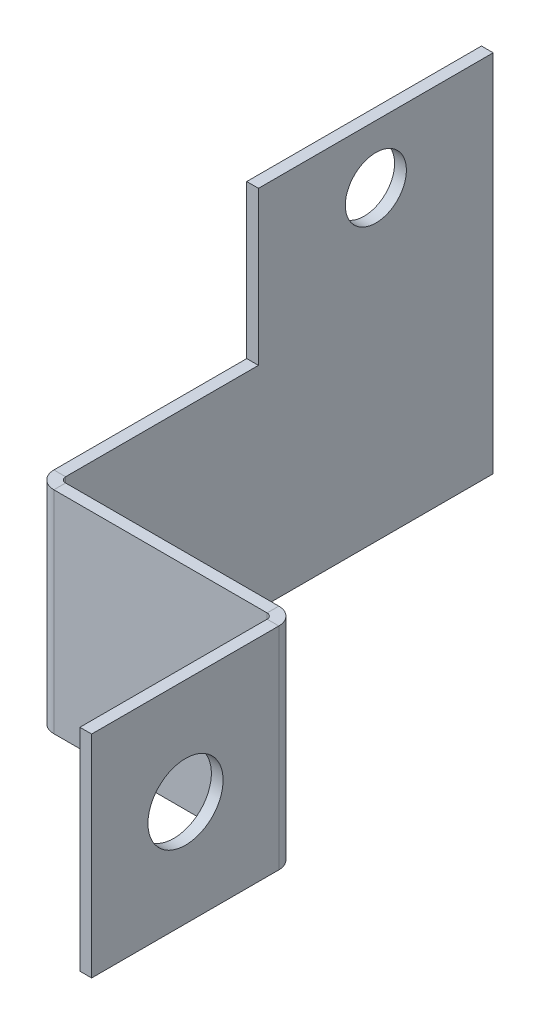
ISO-10303-21;
HEADER;
FILE_DESCRIPTION(('STEP AP214'),'2;1');
FILE_NAME('part.step','',(''),(''),'','','');
FILE_SCHEMA(('AUTOMOTIVE_DESIGN { 1 0 10303 214 1 1 1 1 }'));
ENDSEC;
DATA;
#1=APPLICATION_CONTEXT('core data for automotive mechanical design processes');
#2=APPLICATION_PROTOCOL_DEFINITION('international standard','automotive_design',2000,#1);
#3=PRODUCT_CONTEXT('',#1,'mechanical');
#4=PRODUCT('Part','Part','',(#3));
#5=PRODUCT_RELATED_PRODUCT_CATEGORY('part','',(#4));
#6=PRODUCT_DEFINITION_FORMATION('','',#4);
#7=PRODUCT_DEFINITION_CONTEXT('part definition',#1,'design');
#8=PRODUCT_DEFINITION('design','',#6,#7);
#9=PRODUCT_DEFINITION_SHAPE('','',#8);
#10=(LENGTH_UNIT() NAMED_UNIT(*) SI_UNIT(.MILLI.,.METRE.));
#11=(NAMED_UNIT(*) PLANE_ANGLE_UNIT() SI_UNIT($,.RADIAN.));
#12=(NAMED_UNIT(*) SI_UNIT($,.STERADIAN.) SOLID_ANGLE_UNIT());
#13=UNCERTAINTY_MEASURE_WITH_UNIT(LENGTH_MEASURE(1.E-05),#10,'distance_accuracy_value','');
#14=(GEOMETRIC_REPRESENTATION_CONTEXT(3) GLOBAL_UNCERTAINTY_ASSIGNED_CONTEXT((#13)) GLOBAL_UNIT_ASSIGNED_CONTEXT((#10,
#11,#12)) REPRESENTATION_CONTEXT('',''));
#15=CARTESIAN_POINT('',(0.,0.,0.));
#16=DIRECTION('',(0.,0.,1.));
#17=DIRECTION('',(1.,0.,0.));
#18=AXIS2_PLACEMENT_3D('',#15,#16,#17);
#19=CARTESIAN_POINT('',(0.,-49.3141,-1.5875));
#20=DIRECTION('',(0.,-1.,0.));
#21=DIRECTION('',(0.,0.,-1.));
#22=AXIS2_PLACEMENT_3D('',#19,#20,#21);
#23=PLANE('',#22);
#24=DIRECTION('',(1.,0.,0.));
#25=VECTOR('',#24,1.);
#26=CARTESIAN_POINT('',(0.,-49.3141,-1.5875));
#27=LINE('',#26,#25);
#28=CARTESIAN_POINT('',(60.24118,-49.3141,-1.5875));
#29=VERTEX_POINT('',#28);
#30=CARTESIAN_POINT('',(89.08288,-49.3141,-1.5875));
#31=VERTEX_POINT('',#30);
#32=EDGE_CURVE('E226',#29,#31,#27,.T.);
#33=ORIENTED_EDGE('',*,*,#32,.T.);
#34=DIRECTION('',(0.,0.,1.));
#35=VECTOR('',#34,1.);
#36=CARTESIAN_POINT('',(89.08288,-49.3141,-1.5875));
#37=LINE('',#36,#35);
#38=CARTESIAN_POINT('',(89.08288,-49.3141,0.));
#39=VERTEX_POINT('',#38);
#40=EDGE_CURVE('E12',#31,#39,#37,.T.);
#41=ORIENTED_EDGE('',*,*,#40,.T.);
#42=DIRECTION('',(1.,0.,0.));
#43=VECTOR('',#42,1.);
#44=CARTESIAN_POINT('',(0.,-49.3141,0.));
#45=LINE('',#44,#43);
#46=CARTESIAN_POINT('',(60.24118,-49.3141,0.));
#47=VERTEX_POINT('',#46);
#48=EDGE_CURVE('E279',#47,#39,#45,.T.);
#49=ORIENTED_EDGE('',*,*,#48,.F.);
#50=DIRECTION('',(0.,0.,1.));
#51=VECTOR('',#50,1.);
#52=CARTESIAN_POINT('',(60.24118,-49.3141,-1.5875));
#53=LINE('',#52,#51);
#54=EDGE_CURVE('E203',#29,#47,#53,.T.);
#55=ORIENTED_EDGE('',*,*,#54,.F.);
#56=EDGE_LOOP('',(#33,#41,#49,#55));
#57=FACE_BOUND('',#56,.T.);
#58=ADVANCED_FACE('F45',(#57),#23,.T.);
#59=CARTESIAN_POINT('',(0.,0.,0.));
#60=DIRECTION('',(0.,0.,1.));
#61=DIRECTION('',(1.,0.,0.));
#62=AXIS2_PLACEMENT_3D('',#59,#60,#61);
#63=PLANE('',#62);
#64=ORIENTED_EDGE('',*,*,#48,.T.);
#65=DIRECTION('',(0.,1.,0.));
#66=VECTOR('',#65,1.);
#67=CARTESIAN_POINT('',(89.08288,0.,0.));
#68=LINE('',#67,#66);
#69=CARTESIAN_POINT('',(89.08288,-20.7391,0.));
#70=VERTEX_POINT('',#69);
#71=EDGE_CURVE('E53',#39,#70,#68,.T.);
#72=ORIENTED_EDGE('',*,*,#71,.T.);
#73=DIRECTION('',(-1.,0.,0.));
#74=VECTOR('',#73,1.);
#75=CARTESIAN_POINT('',(116.80698,-20.7391,0.));
#76=LINE('',#75,#74);
#77=CARTESIAN_POINT('',(60.24118,-20.7391,0.));
#78=VERTEX_POINT('',#77);
#79=EDGE_CURVE('E278',#70,#78,#76,.T.);
#80=ORIENTED_EDGE('',*,*,#79,.T.);
#81=DIRECTION('',(0.,1.,0.));
#82=VECTOR('',#81,1.);
#83=CARTESIAN_POINT('',(60.24118,0.,0.));
#84=LINE('',#83,#82);
#85=EDGE_CURVE('E214',#47,#78,#84,.T.);
#86=ORIENTED_EDGE('',*,*,#85,.F.);
#87=EDGE_LOOP('',(#64,#72,#80,#86));
#88=FACE_BOUND('',#87,.T.);
#89=ADVANCED_FACE('F342',(#88),#63,.T.);
#90=CARTESIAN_POINT('',(116.80698,-20.7391,-1.5875));
#91=DIRECTION('',(0.,1.,0.));
#92=DIRECTION('',(-1.,0.,0.));
#93=AXIS2_PLACEMENT_3D('',#90,#91,#92);
#94=PLANE('',#93);
#95=ORIENTED_EDGE('',*,*,#79,.F.);
#96=DIRECTION('',(0.,0.,-1.));
#97=VECTOR('',#96,1.);
#98=CARTESIAN_POINT('',(89.08288,-20.7391,-1.5875));
#99=LINE('',#98,#97);
#100=CARTESIAN_POINT('',(89.08288,-20.7391,-1.5875));
#101=VERTEX_POINT('',#100);
#102=EDGE_CURVE('E271',#70,#101,#99,.T.);
#103=ORIENTED_EDGE('',*,*,#102,.T.);
#104=DIRECTION('',(-1.,0.,0.));
#105=VECTOR('',#104,1.);
#106=CARTESIAN_POINT('',(116.80698,-20.7391,-1.5875));
#107=LINE('',#106,#105);
#108=CARTESIAN_POINT('',(60.24118,-20.7391,-1.5875));
#109=VERTEX_POINT('',#108);
#110=EDGE_CURVE('E48',#101,#109,#107,.T.);
#111=ORIENTED_EDGE('',*,*,#110,.T.);
#112=DIRECTION('',(0.,0.,-1.));
#113=VECTOR('',#112,1.);
#114=CARTESIAN_POINT('',(60.24118,-20.7391,-1.5875));
#115=LINE('',#114,#113);
#116=EDGE_CURVE('E211',#78,#109,#115,.T.);
#117=ORIENTED_EDGE('',*,*,#116,.F.);
#118=EDGE_LOOP('',(#95,#103,#111,#117));
#119=FACE_BOUND('',#118,.T.);
#120=ADVANCED_FACE('F287',(#119),#94,.T.);
#121=CARTESIAN_POINT('',(59.5045799999998,-20.7391,56.6455681587106));
#122=DIRECTION('',(0.,1.,0.));
#123=DIRECTION('',(0.,0.,-1.));
#124=AXIS2_PLACEMENT_3D('',#121,#122,#123);
#125=PLANE('',#124);
#126=DIRECTION('',(0.,0.,-1.));
#127=VECTOR('',#126,1.);
#128=CARTESIAN_POINT('',(57.9170799999998,-20.7391,56.6455681587106));
#129=LINE('',#128,#127);
#130=CARTESIAN_POINT('',(57.91708,-20.7391,-2.32410000000002));
#131=VERTEX_POINT('',#130);
#132=CARTESIAN_POINT('',(57.9170800000001,-20.7391,-28.4114118412895));
#133=VERTEX_POINT('',#132);
#134=EDGE_CURVE('E246',#131,#133,#129,.T.);
#135=ORIENTED_EDGE('',*,*,#134,.F.);
#136=DIRECTION('',(1.,0.,0.));
#137=VECTOR('',#136,1.);
#138=CARTESIAN_POINT('',(59.50458,-20.7391,-2.32410000000001));
#139=LINE('',#138,#137);
#140=CARTESIAN_POINT('',(59.50458,-20.7391,-2.3241));
#141=VERTEX_POINT('',#140);
#142=EDGE_CURVE('E258',#131,#141,#139,.T.);
#143=ORIENTED_EDGE('',*,*,#142,.T.);
#144=DIRECTION('',(0.,0.,-1.));
#145=VECTOR('',#144,1.);
#146=CARTESIAN_POINT('',(59.5045799999998,-20.7391,56.6455681587106));
#147=LINE('',#146,#145);
#148=CARTESIAN_POINT('',(59.5045800000001,-20.7391,-28.4114118412894));
#149=VERTEX_POINT('',#148);
#150=EDGE_CURVE('E239',#141,#149,#147,.T.);
#151=ORIENTED_EDGE('',*,*,#150,.T.);
#152=DIRECTION('',(-1.,0.,0.));
#153=VECTOR('',#152,1.);
#154=CARTESIAN_POINT('',(59.5045800000001,-20.7391,-28.4114118412894));
#155=LINE('',#154,#153);
#156=EDGE_CURVE('E250',#149,#133,#155,.T.);
#157=ORIENTED_EDGE('',*,*,#156,.T.);
#158=EDGE_LOOP('',(#135,#143,#151,#157));
#159=FACE_BOUND('',#158,.T.);
#160=ADVANCED_FACE('F319',(#159),#125,.T.);
#161=CARTESIAN_POINT('',(59.5045800000002,-49.3141,-60.1614118412894));
#162=DIRECTION('',(0.,-1.,0.));
#163=DIRECTION('',(1.,0.,0.));
#164=AXIS2_PLACEMENT_3D('',#161,#162,#163);
#165=PLANE('',#164);
#166=DIRECTION('',(0.,0.,1.));
#167=VECTOR('',#166,1.);
#168=CARTESIAN_POINT('',(59.5045800000002,-49.3141,-60.1614118412894));
#169=LINE('',#168,#167);
#170=CARTESIAN_POINT('',(59.5045800000002,-49.3141,-60.1614118412894));
#171=VERTEX_POINT('',#170);
#172=CARTESIAN_POINT('',(59.50458,-49.3141,-2.32410000000002));
#173=VERTEX_POINT('',#172);
#174=EDGE_CURVE('E234',#171,#173,#169,.T.);
#175=ORIENTED_EDGE('',*,*,#174,.T.);
#176=DIRECTION('',(-1.,0.,0.));
#177=VECTOR('',#176,1.);
#178=CARTESIAN_POINT('',(59.50458,-49.3141,-2.32410000000001));
#179=LINE('',#178,#177);
#180=CARTESIAN_POINT('',(57.91708,-49.3141,-2.32410000000003));
#181=VERTEX_POINT('',#180);
#182=EDGE_CURVE('E262',#173,#181,#179,.T.);
#183=ORIENTED_EDGE('',*,*,#182,.T.);
#184=DIRECTION('',(0.,0.,1.));
#185=VECTOR('',#184,1.);
#186=CARTESIAN_POINT('',(57.9170800000002,-49.3141,-60.1614118412894));
#187=LINE('',#186,#185);
#188=CARTESIAN_POINT('',(57.9170800000002,-49.3141,-60.1614118412894));
#189=VERTEX_POINT('',#188);
#190=EDGE_CURVE('E69',#189,#181,#187,.T.);
#191=ORIENTED_EDGE('',*,*,#190,.F.);
#192=DIRECTION('',(-1.,0.,0.));
#193=VECTOR('',#192,1.);
#194=CARTESIAN_POINT('',(59.5045800000002,-49.3141,-60.1614118412894));
#195=LINE('',#194,#193);
#196=EDGE_CURVE('E253',#171,#189,#195,.T.);
#197=ORIENTED_EDGE('',*,*,#196,.F.);
#198=EDGE_LOOP('',(#175,#183,#191,#197));
#199=FACE_BOUND('',#198,.T.);
#200=ADVANCED_FACE('F310',(#199),#165,.T.);
#201=CARTESIAN_POINT('',(57.9170800000002,0.,-60.1614118412894));
#202=DIRECTION('',(-1.,0.,0.));
#203=DIRECTION('',(0.,0.,1.));
#204=AXIS2_PLACEMENT_3D('',#201,#202,#203);
#205=PLANE('',#204);
#206=CARTESIAN_POINT('',(57.9170800000002,-7.87399999999999,-44.2864118412894));
#207=DIRECTION('',(-1.,0.,0.));
#208=DIRECTION('',(0.,0.,1.));
#209=AXIS2_PLACEMENT_3D('',#206,#207,#208);
#210=CIRCLE('',#209,4.1275);
#211=CARTESIAN_POINT('',(57.9170800000001,-7.87399999999999,-40.1589118412895));
#212=VERTEX_POINT('',#211);
#213=EDGE_CURVE('E223',#212,#212,#210,.T.);
#214=ORIENTED_EDGE('',*,*,#213,.F.);
#215=EDGE_LOOP('',(#214));
#216=FACE_BOUND('',#215,.T.);
#217=ORIENTED_EDGE('',*,*,#190,.T.);
#218=DIRECTION('',(0.,1.,0.));
#219=VECTOR('',#218,1.);
#220=CARTESIAN_POINT('',(57.91708,0.,-2.32410000000002));
#221=LINE('',#220,#219);
#222=EDGE_CURVE('E260',#181,#131,#221,.T.);
#223=ORIENTED_EDGE('',*,*,#222,.T.);
#224=ORIENTED_EDGE('',*,*,#134,.T.);
#225=DIRECTION('',(0.,1.,0.));
#226=VECTOR('',#225,1.);
#227=CARTESIAN_POINT('',(57.9170800000001,-20.7391,-28.4114118412895));
#228=LINE('',#227,#226);
#229=CARTESIAN_POINT('',(57.9170800000001,0.,-28.4114118412894));
#230=VERTEX_POINT('',#229);
#231=EDGE_CURVE('E231',#133,#230,#228,.T.);
#232=ORIENTED_EDGE('',*,*,#231,.T.);
#233=DIRECTION('',(0.,0.,-1.));
#234=VECTOR('',#233,1.);
#235=CARTESIAN_POINT('',(57.9170800000001,0.,-28.4114118412894));
#236=LINE('',#235,#234);
#237=CARTESIAN_POINT('',(57.9170800000002,0.,-60.1614118412894));
#238=VERTEX_POINT('',#237);
#239=EDGE_CURVE('E222',#230,#238,#236,.T.);
#240=ORIENTED_EDGE('',*,*,#239,.T.);
#241=DIRECTION('',(0.,-1.,0.));
#242=VECTOR('',#241,1.);
#243=CARTESIAN_POINT('',(57.9170800000002,0.,-60.1614118412894));
#244=LINE('',#243,#242);
#245=EDGE_CURVE('E242',#238,#189,#244,.T.);
#246=ORIENTED_EDGE('',*,*,#245,.T.);
#247=EDGE_LOOP('',(#217,#223,#224,#232,#240,#246));
#248=FACE_BOUND('',#247,.T.);
#249=ADVANCED_FACE('F317',(#216,#248),#205,.T.);
#250=CARTESIAN_POINT('',(59.5045800000001,0.,-28.4114118412894));
#251=DIRECTION('',(0.,1.,0.));
#252=DIRECTION('',(0.,0.,-1.));
#253=AXIS2_PLACEMENT_3D('',#250,#251,#252);
#254=PLANE('',#253);
#255=ORIENTED_EDGE('',*,*,#239,.F.);
#256=DIRECTION('',(-1.,0.,0.));
#257=VECTOR('',#256,1.);
#258=CARTESIAN_POINT('',(59.5045800000001,0.,-28.4114118412894));
#259=LINE('',#258,#257);
#260=CARTESIAN_POINT('',(59.5045800000001,0.,-28.4114118412894));
#261=VERTEX_POINT('',#260);
#262=EDGE_CURVE('E247',#261,#230,#259,.T.);
#263=ORIENTED_EDGE('',*,*,#262,.F.);
#264=DIRECTION('',(0.,0.,-1.));
#265=VECTOR('',#264,1.);
#266=CARTESIAN_POINT('',(59.5045800000001,0.,-28.4114118412894));
#267=LINE('',#266,#265);
#268=CARTESIAN_POINT('',(59.5045800000002,0.,-60.1614118412894));
#269=VERTEX_POINT('',#268);
#270=EDGE_CURVE('E227',#261,#269,#267,.T.);
#271=ORIENTED_EDGE('',*,*,#270,.T.);
#272=DIRECTION('',(-1.,0.,0.));
#273=VECTOR('',#272,1.);
#274=CARTESIAN_POINT('',(59.5045800000002,0.,-60.1614118412894));
#275=LINE('',#274,#273);
#276=EDGE_CURVE('E238',#269,#238,#275,.T.);
#277=ORIENTED_EDGE('',*,*,#276,.T.);
#278=EDGE_LOOP('',(#255,#263,#271,#277));
#279=FACE_BOUND('',#278,.T.);
#280=ADVANCED_FACE('F327',(#279),#254,.T.);
#281=CARTESIAN_POINT('',(59.5045800000001,-20.7391,-28.4114118412894));
#282=DIRECTION('',(0.,0.,1.));
#283=DIRECTION('',(1.,0.,0.));
#284=AXIS2_PLACEMENT_3D('',#281,#282,#283);
#285=PLANE('',#284);
#286=ORIENTED_EDGE('',*,*,#231,.F.);
#287=ORIENTED_EDGE('',*,*,#156,.F.);
#288=DIRECTION('',(0.,1.,0.));
#289=VECTOR('',#288,1.);
#290=CARTESIAN_POINT('',(59.5045800000001,-20.7391,-28.4114118412894));
#291=LINE('',#290,#289);
#292=EDGE_CURVE('E235',#149,#261,#291,.T.);
#293=ORIENTED_EDGE('',*,*,#292,.T.);
#294=ORIENTED_EDGE('',*,*,#262,.T.);
#295=EDGE_LOOP('',(#286,#287,#293,#294));
#296=FACE_BOUND('',#295,.T.);
#297=ADVANCED_FACE('F323',(#296),#285,.T.);
#298=CARTESIAN_POINT('',(59.5045800000002,0.,-60.1614118412894));
#299=DIRECTION('',(0.,0.,-1.));
#300=DIRECTION('',(0.,-1.,0.));
#301=AXIS2_PLACEMENT_3D('',#298,#299,#300);
#302=PLANE('',#301);
#303=ORIENTED_EDGE('',*,*,#245,.F.);
#304=ORIENTED_EDGE('',*,*,#276,.F.);
#305=DIRECTION('',(0.,-1.,0.));
#306=VECTOR('',#305,1.);
#307=CARTESIAN_POINT('',(59.5045800000002,0.,-60.1614118412894));
#308=LINE('',#307,#306);
#309=EDGE_CURVE('E230',#269,#171,#308,.T.);
#310=ORIENTED_EDGE('',*,*,#309,.T.);
#311=ORIENTED_EDGE('',*,*,#196,.T.);
#312=EDGE_LOOP('',(#303,#304,#310,#311));
#313=FACE_BOUND('',#312,.T.);
#314=ADVANCED_FACE('F330',(#313),#302,.T.);
#315=CARTESIAN_POINT('',(59.5045800000002,0.,-60.1614118412894));
#316=DIRECTION('',(-1.,0.,0.));
#317=DIRECTION('',(0.,0.,1.));
#318=AXIS2_PLACEMENT_3D('',#315,#316,#317);
#319=PLANE('',#318);
#320=DIRECTION('',(0.,1.,0.));
#321=VECTOR('',#320,1.);
#322=CARTESIAN_POINT('',(59.50458,0.,-2.32410000000001));
#323=LINE('',#322,#321);
#324=EDGE_CURVE('E249',#173,#141,#323,.T.);
#325=ORIENTED_EDGE('',*,*,#324,.F.);
#326=ORIENTED_EDGE('',*,*,#174,.F.);
#327=ORIENTED_EDGE('',*,*,#309,.F.);
#328=ORIENTED_EDGE('',*,*,#270,.F.);
#329=ORIENTED_EDGE('',*,*,#292,.F.);
#330=ORIENTED_EDGE('',*,*,#150,.F.);
#331=EDGE_LOOP('',(#325,#326,#327,#328,#329,#330));
#332=FACE_BOUND('',#331,.T.);
#333=CARTESIAN_POINT('',(59.5045800000002,-7.87399999999999,-44.2864118412894));
#334=DIRECTION('',(-1.,0.,0.));
#335=DIRECTION('',(0.,0.,1.));
#336=AXIS2_PLACEMENT_3D('',#333,#334,#335);
#337=CIRCLE('',#336,4.1275);
#338=CARTESIAN_POINT('',(59.5045800000001,-7.87399999999999,-40.1589118412894));
#339=VERTEX_POINT('',#338);
#340=EDGE_CURVE('E219',#339,#339,#337,.T.);
#341=ORIENTED_EDGE('',*,*,#340,.T.);
#342=EDGE_LOOP('',(#341));
#343=FACE_BOUND('',#342,.T.);
#344=ADVANCED_FACE('F304',(#332,#343),#319,.F.);
#345=CARTESIAN_POINT('',(59.5045800000002,-7.87399999999999,-44.2864118412894));
#346=DIRECTION('',(-1.,0.,0.));
#347=DIRECTION('',(0.,0.,1.));
#348=AXIS2_PLACEMENT_3D('',#345,#346,#347);
#349=CYLINDRICAL_SURFACE('',#348,4.1275);
#350=ORIENTED_EDGE('',*,*,#340,.F.);
#351=EDGE_LOOP('',(#350));
#352=FACE_BOUND('',#351,.T.);
#353=ORIENTED_EDGE('',*,*,#213,.T.);
#354=EDGE_LOOP('',(#353));
#355=FACE_BOUND('',#354,.T.);
#356=ADVANCED_FACE('F337',(#352,#355),#349,.F.);
#357=CARTESIAN_POINT('',(0.,0.,-1.5875));
#358=DIRECTION('',(0.,0.,1.));
#359=DIRECTION('',(1.,0.,0.));
#360=AXIS2_PLACEMENT_3D('',#357,#358,#359);
#361=PLANE('',#360);
#362=DIRECTION('',(0.,1.,0.));
#363=VECTOR('',#362,1.);
#364=CARTESIAN_POINT('',(89.08288,0.,-1.5875));
#365=LINE('',#364,#363);
#366=EDGE_CURVE('E264',#31,#101,#365,.T.);
#367=ORIENTED_EDGE('',*,*,#366,.F.);
#368=ORIENTED_EDGE('',*,*,#32,.F.);
#369=DIRECTION('',(0.,1.,0.));
#370=VECTOR('',#369,1.);
#371=CARTESIAN_POINT('',(60.24118,0.,-1.5875));
#372=LINE('',#371,#370);
#373=EDGE_CURVE('E208',#29,#109,#372,.T.);
#374=ORIENTED_EDGE('',*,*,#373,.T.);
#375=ORIENTED_EDGE('',*,*,#110,.F.);
#376=EDGE_LOOP('',(#367,#368,#374,#375));
#377=FACE_BOUND('',#376,.T.);
#378=ADVANCED_FACE('F291',(#377),#361,.F.);
#379=CARTESIAN_POINT('',(60.24118,-49.3141,-2.3241));
#380=DIRECTION('',(0.,1.,0.));
#381=DIRECTION('',(0.,0.,1.));
#382=AXIS2_PLACEMENT_3D('',#379,#380,#381);
#383=PLANE('',#382);
#384=ORIENTED_EDGE('',*,*,#54,.T.);
#385=CARTESIAN_POINT('',(60.24118,-49.3141,-2.3241));
#386=DIRECTION('',(0.,1.,0.));
#387=DIRECTION('',(-1.,0.,0.));
#388=AXIS2_PLACEMENT_3D('',#385,#386,#387);
#389=CIRCLE('',#388,2.3241);
#390=EDGE_CURVE('E192',#47,#181,#389,.F.);
#391=ORIENTED_EDGE('',*,*,#390,.T.);
#392=ORIENTED_EDGE('',*,*,#182,.F.);
#393=CARTESIAN_POINT('',(60.24118,-49.3141,-2.3241));
#394=DIRECTION('',(0.,-1.,0.));
#395=DIRECTION('',(0.,0.,1.));
#396=AXIS2_PLACEMENT_3D('',#393,#394,#395);
#397=CIRCLE('',#396,0.736599999999998);
#398=EDGE_CURVE('E196',#29,#173,#397,.T.);
#399=ORIENTED_EDGE('',*,*,#398,.F.);
#400=EDGE_LOOP('',(#384,#391,#392,#399));
#401=FACE_BOUND('',#400,.T.);
#402=ADVANCED_FACE('F313',(#401),#383,.F.);
#403=CARTESIAN_POINT('',(60.24118,-20.7391,-2.3241));
#404=DIRECTION('',(0.,-1.,0.));
#405=DIRECTION('',(0.,0.,-1.));
#406=AXIS2_PLACEMENT_3D('',#403,#404,#405);
#407=PLANE('',#406);
#408=ORIENTED_EDGE('',*,*,#142,.F.);
#409=CARTESIAN_POINT('',(60.24118,-20.7391,-2.3241));
#410=DIRECTION('',(0.,1.,0.));
#411=DIRECTION('',(-1.,0.,0.));
#412=AXIS2_PLACEMENT_3D('',#409,#410,#411);
#413=CIRCLE('',#412,2.3241);
#414=EDGE_CURVE('E200',#131,#78,#413,.T.);
#415=ORIENTED_EDGE('',*,*,#414,.T.);
#416=ORIENTED_EDGE('',*,*,#116,.T.);
#417=CARTESIAN_POINT('',(60.24118,-20.7391,-2.3241));
#418=DIRECTION('',(0.,1.,0.));
#419=DIRECTION('',(0.,0.,-1.));
#420=AXIS2_PLACEMENT_3D('',#417,#418,#419);
#421=CIRCLE('',#420,0.736600000000002);
#422=EDGE_CURVE('E199',#141,#109,#421,.T.);
#423=ORIENTED_EDGE('',*,*,#422,.F.);
#424=EDGE_LOOP('',(#408,#415,#416,#423));
#425=FACE_BOUND('',#424,.T.);
#426=ADVANCED_FACE('F297',(#425),#407,.F.);
#427=CARTESIAN_POINT('',(60.24118,-63.7464426767011,-2.3241));
#428=DIRECTION('',(0.,1.,0.));
#429=DIRECTION('',(-1.,0.,0.));
#430=AXIS2_PLACEMENT_3D('',#427,#428,#429);
#431=CYLINDRICAL_SURFACE('',#430,0.7366);
#432=ORIENTED_EDGE('',*,*,#422,.T.);
#433=ORIENTED_EDGE('',*,*,#373,.F.);
#434=ORIENTED_EDGE('',*,*,#398,.T.);
#435=ORIENTED_EDGE('',*,*,#324,.T.);
#436=EDGE_LOOP('',(#432,#433,#434,#435));
#437=FACE_BOUND('',#436,.T.);
#438=ADVANCED_FACE('F299',(#437),#431,.F.);
#439=CARTESIAN_POINT('',(60.24118,-63.7464426767011,-2.3241));
#440=DIRECTION('',(0.,1.,0.));
#441=DIRECTION('',(-1.,0.,0.));
#442=AXIS2_PLACEMENT_3D('',#439,#440,#441);
#443=CYLINDRICAL_SURFACE('',#442,2.3241);
#444=ORIENTED_EDGE('',*,*,#414,.F.);
#445=ORIENTED_EDGE('',*,*,#222,.F.);
#446=ORIENTED_EDGE('',*,*,#390,.F.);
#447=ORIENTED_EDGE('',*,*,#85,.T.);
#448=EDGE_LOOP('',(#444,#445,#446,#447));
#449=FACE_BOUND('',#448,.T.);
#450=ADVANCED_FACE('F316',(#449),#443,.T.);
#451=CARTESIAN_POINT('',(89.08288,-49.3141,0.7366));
#452=DIRECTION('',(0.,-1.,0.));
#453=DIRECTION('',(0.,0.,-1.));
#454=AXIS2_PLACEMENT_3D('',#451,#452,#453);
#455=PLANE('',#454);
#456=DIRECTION('',(-1.,0.,0.));
#457=VECTOR('',#456,1.);
#458=CARTESIAN_POINT('',(91.40698,-49.3141,0.736600000000032));
#459=LINE('',#458,#457);
#460=CARTESIAN_POINT('',(91.40698,-49.3141,0.736600000000009));
#461=VERTEX_POINT('',#460);
#462=CARTESIAN_POINT('',(89.81948,-49.3141,0.736600000000004));
#463=VERTEX_POINT('',#462);
#464=EDGE_CURVE('E155',#461,#463,#459,.T.);
#465=ORIENTED_EDGE('',*,*,#464,.T.);
#466=CARTESIAN_POINT('',(89.08288,-49.3141,0.7366));
#467=DIRECTION('',(0.,-1.,0.));
#468=DIRECTION('',(0.,0.,-1.));
#469=AXIS2_PLACEMENT_3D('',#466,#467,#468);
#470=CIRCLE('',#469,0.7366);
#471=EDGE_CURVE('E61',#463,#39,#470,.F.);
#472=ORIENTED_EDGE('',*,*,#471,.T.);
#473=ORIENTED_EDGE('',*,*,#40,.F.);
#474=CARTESIAN_POINT('',(89.08288,-49.3141,0.7366));
#475=DIRECTION('',(0.,1.,0.));
#476=DIRECTION('',(0.,0.,-1.));
#477=AXIS2_PLACEMENT_3D('',#474,#475,#476);
#478=CIRCLE('',#477,2.3241);
#479=EDGE_CURVE('E185',#461,#31,#478,.T.);
#480=ORIENTED_EDGE('',*,*,#479,.F.);
#481=EDGE_LOOP('',(#465,#472,#473,#480));
#482=FACE_BOUND('',#481,.T.);
#483=ADVANCED_FACE('F359',(#482),#455,.T.);
#484=CARTESIAN_POINT('',(89.08288,-20.7391,0.7366));
#485=DIRECTION('',(0.,1.,0.));
#486=DIRECTION('',(0.,0.,1.));
#487=AXIS2_PLACEMENT_3D('',#484,#485,#486);
#488=PLANE('',#487);
#489=CARTESIAN_POINT('',(89.08288,-20.7391,0.7366));
#490=DIRECTION('',(0.,-1.,0.));
#491=DIRECTION('',(0.,0.,-1.));
#492=AXIS2_PLACEMENT_3D('',#489,#490,#491);
#493=CIRCLE('',#492,0.7366);
#494=CARTESIAN_POINT('',(89.81948,-20.7391,0.736600000000032));
#495=VERTEX_POINT('',#494);
#496=EDGE_CURVE('E189',#70,#495,#493,.T.);
#497=ORIENTED_EDGE('',*,*,#496,.T.);
#498=DIRECTION('',(1.,0.,0.));
#499=VECTOR('',#498,1.);
#500=CARTESIAN_POINT('',(91.40698,-20.7391,0.736600000000032));
#501=LINE('',#500,#499);
#502=CARTESIAN_POINT('',(91.40698,-20.7391,0.736600000000032));
#503=VERTEX_POINT('',#502);
#504=EDGE_CURVE('E173',#495,#503,#501,.T.);
#505=ORIENTED_EDGE('',*,*,#504,.T.);
#506=CARTESIAN_POINT('',(89.08288,-20.7391,0.7366));
#507=DIRECTION('',(0.,-1.,0.));
#508=DIRECTION('',(0.,0.,1.));
#509=AXIS2_PLACEMENT_3D('',#506,#507,#508);
#510=CIRCLE('',#509,2.3241);
#511=EDGE_CURVE('E188',#101,#503,#510,.T.);
#512=ORIENTED_EDGE('',*,*,#511,.F.);
#513=ORIENTED_EDGE('',*,*,#102,.F.);
#514=EDGE_LOOP('',(#497,#505,#512,#513));
#515=FACE_BOUND('',#514,.T.);
#516=ADVANCED_FACE('F352',(#515),#488,.T.);
#517=CARTESIAN_POINT('',(89.08288,-6.30675732329888,0.7366));
#518=DIRECTION('',(0.,-1.,0.));
#519=DIRECTION('',(0.,0.,-1.));
#520=AXIS2_PLACEMENT_3D('',#517,#518,#519);
#521=CYLINDRICAL_SURFACE('',#520,2.3241);
#522=ORIENTED_EDGE('',*,*,#366,.T.);
#523=ORIENTED_EDGE('',*,*,#511,.T.);
#524=DIRECTION('',(0.,1.,0.));
#525=VECTOR('',#524,1.);
#526=CARTESIAN_POINT('',(91.40698,0.,0.736600000000032));
#527=LINE('',#526,#525);
#528=EDGE_CURVE('E357',#461,#503,#527,.T.);
#529=ORIENTED_EDGE('',*,*,#528,.F.);
#530=ORIENTED_EDGE('',*,*,#479,.T.);
#531=EDGE_LOOP('',(#522,#523,#529,#530));
#532=FACE_BOUND('',#531,.T.);
#533=ADVANCED_FACE('F356',(#532),#521,.T.);
#534=CARTESIAN_POINT('',(89.08288,-6.30675732329888,0.7366));
#535=DIRECTION('',(0.,-1.,0.));
#536=DIRECTION('',(0.,0.,-1.));
#537=AXIS2_PLACEMENT_3D('',#534,#535,#536);
#538=CYLINDRICAL_SURFACE('',#537,0.7366);
#539=ORIENTED_EDGE('',*,*,#71,.F.);
#540=ORIENTED_EDGE('',*,*,#471,.F.);
#541=DIRECTION('',(0.,1.,0.));
#542=VECTOR('',#541,1.);
#543=CARTESIAN_POINT('',(89.81948,0.,0.736600000000032));
#544=LINE('',#543,#542);
#545=EDGE_CURVE('E178',#463,#495,#544,.T.);
#546=ORIENTED_EDGE('',*,*,#545,.T.);
#547=ORIENTED_EDGE('',*,*,#496,.F.);
#548=EDGE_LOOP('',(#539,#540,#546,#547));
#549=FACE_BOUND('',#548,.T.);
#550=ADVANCED_FACE('F349',(#549),#538,.F.);
#551=CARTESIAN_POINT('',(91.4069799999999,-49.3141,26.0568318412895));
#552=DIRECTION('',(0.,0.,1.));
#553=DIRECTION('',(1.,0.,0.));
#554=AXIS2_PLACEMENT_3D('',#551,#552,#553);
#555=PLANE('',#554);
#556=DIRECTION('',(0.,1.,0.));
#557=VECTOR('',#556,1.);
#558=CARTESIAN_POINT('',(89.8194799999999,-49.3141,26.0568318412895));
#559=LINE('',#558,#557);
#560=CARTESIAN_POINT('',(89.8194799999999,-49.3141,26.0568318412895));
#561=VERTEX_POINT('',#560);
#562=CARTESIAN_POINT('',(89.8194799999999,-20.7391,26.0568318412895));
#563=VERTEX_POINT('',#562);
#564=EDGE_CURVE('E166',#561,#563,#559,.T.);
#565=ORIENTED_EDGE('',*,*,#564,.F.);
#566=DIRECTION('',(-1.,0.,0.));
#567=VECTOR('',#566,1.);
#568=CARTESIAN_POINT('',(91.4069799999999,-49.3141,26.0568318412895));
#569=LINE('',#568,#567);
#570=CARTESIAN_POINT('',(91.4069799999999,-49.3141,26.0568318412895));
#571=VERTEX_POINT('',#570);
#572=EDGE_CURVE('E153',#571,#561,#569,.T.);
#573=ORIENTED_EDGE('',*,*,#572,.F.);
#574=DIRECTION('',(0.,1.,0.));
#575=VECTOR('',#574,1.);
#576=CARTESIAN_POINT('',(91.4069799999999,-49.3141,26.0568318412895));
#577=LINE('',#576,#575);
#578=CARTESIAN_POINT('',(91.4069799999999,-20.7391,26.0568318412895));
#579=VERTEX_POINT('',#578);
#580=EDGE_CURVE('E164',#571,#579,#577,.T.);
#581=ORIENTED_EDGE('',*,*,#580,.T.);
#582=DIRECTION('',(-1.,0.,0.));
#583=VECTOR('',#582,1.);
#584=CARTESIAN_POINT('',(91.4069799999999,-20.7391,26.0568318412895));
#585=LINE('',#584,#583);
#586=EDGE_CURVE('E172',#579,#563,#585,.T.);
#587=ORIENTED_EDGE('',*,*,#586,.T.);
#588=EDGE_LOOP('',(#565,#573,#581,#587));
#589=FACE_BOUND('',#588,.T.);
#590=ADVANCED_FACE('F163',(#589),#555,.T.);
#591=CARTESIAN_POINT('',(91.4069799999999,-35.0266,13.3568318412895));
#592=DIRECTION('',(-1.,0.,0.));
#593=DIRECTION('',(0.,0.,1.));
#594=AXIS2_PLACEMENT_3D('',#591,#592,#593);
#595=CYLINDRICAL_SURFACE('',#594,5.07999999999999);
#596=CARTESIAN_POINT('',(91.4069799999999,-35.0266,13.3568318412895));
#597=DIRECTION('',(-1.,0.,0.));
#598=DIRECTION('',(0.,0.,1.));
#599=AXIS2_PLACEMENT_3D('',#596,#597,#598);
#600=CIRCLE('',#599,5.07999999999999);
#601=CARTESIAN_POINT('',(91.4069799999999,-35.0266,18.4368318412894));
#602=VERTEX_POINT('',#601);
#603=EDGE_CURVE('E599',#602,#602,#600,.T.);
#604=ORIENTED_EDGE('',*,*,#603,.F.);
#605=EDGE_LOOP('',(#604));
#606=FACE_BOUND('',#605,.T.);
#607=CARTESIAN_POINT('',(89.8194799999999,-35.0266,13.3568318412895));
#608=DIRECTION('',(-1.,0.,0.));
#609=DIRECTION('',(0.,0.,1.));
#610=AXIS2_PLACEMENT_3D('',#607,#608,#609);
#611=CIRCLE('',#610,5.07999999999999);
#612=CARTESIAN_POINT('',(89.8194799999999,-35.0266,18.4368318412894));
#613=VERTEX_POINT('',#612);
#614=EDGE_CURVE('E175',#613,#613,#611,.T.);
#615=ORIENTED_EDGE('',*,*,#614,.T.);
#616=EDGE_LOOP('',(#615));
#617=FACE_BOUND('',#616,.T.);
#618=ADVANCED_FACE('F531',(#606,#617),#595,.F.);
#619=CARTESIAN_POINT('',(91.4069800000003,0.,-90.7501481587106));
#620=DIRECTION('',(-1.,0.,0.));
#621=DIRECTION('',(0.,0.,1.));
#622=AXIS2_PLACEMENT_3D('',#619,#620,#621);
#623=PLANE('',#622);
#624=ORIENTED_EDGE('',*,*,#603,.T.);
#625=EDGE_LOOP('',(#624));
#626=FACE_BOUND('',#625,.T.);
#627=DIRECTION('',(0.,0.,1.));
#628=VECTOR('',#627,1.);
#629=CARTESIAN_POINT('',(91.4069800000003,-49.3141,-90.7501481587105));
#630=LINE('',#629,#628);
#631=EDGE_CURVE('E150',#461,#571,#630,.T.);
#632=ORIENTED_EDGE('',*,*,#631,.F.);
#633=ORIENTED_EDGE('',*,*,#528,.T.);
#634=DIRECTION('',(0.,0.,-1.));
#635=VECTOR('',#634,1.);
#636=CARTESIAN_POINT('',(91.4069799999999,-20.7391,26.0568318412895));
#637=LINE('',#636,#635);
#638=EDGE_CURVE('E171',#579,#503,#637,.T.);
#639=ORIENTED_EDGE('',*,*,#638,.F.);
#640=ORIENTED_EDGE('',*,*,#580,.F.);
#641=EDGE_LOOP('',(#632,#633,#639,#640));
#642=FACE_BOUND('',#641,.T.);
#643=ADVANCED_FACE('F169',(#626,#642),#623,.F.);
#644=CARTESIAN_POINT('',(91.4069799999999,-20.7391,26.0568318412895));
#645=DIRECTION('',(0.,1.,0.));
#646=DIRECTION('',(0.,0.,-1.));
#647=AXIS2_PLACEMENT_3D('',#644,#645,#646);
#648=PLANE('',#647);
#649=ORIENTED_EDGE('',*,*,#504,.F.);
#650=DIRECTION('',(0.,0.,-1.));
#651=VECTOR('',#650,1.);
#652=CARTESIAN_POINT('',(89.8194799999999,-20.7391,26.0568318412895));
#653=LINE('',#652,#651);
#654=EDGE_CURVE('E159',#563,#495,#653,.T.);
#655=ORIENTED_EDGE('',*,*,#654,.F.);
#656=ORIENTED_EDGE('',*,*,#586,.F.);
#657=ORIENTED_EDGE('',*,*,#638,.T.);
#658=EDGE_LOOP('',(#649,#655,#656,#657));
#659=FACE_BOUND('',#658,.T.);
#660=ADVANCED_FACE('F551',(#659),#648,.T.);
#661=CARTESIAN_POINT('',(89.8194800000003,0.,-90.7501481587106));
#662=DIRECTION('',(-1.,0.,0.));
#663=DIRECTION('',(0.,0.,1.));
#664=AXIS2_PLACEMENT_3D('',#661,#662,#663);
#665=PLANE('',#664);
#666=ORIENTED_EDGE('',*,*,#545,.F.);
#667=DIRECTION('',(0.,0.,1.));
#668=VECTOR('',#667,1.);
#669=CARTESIAN_POINT('',(89.8194800000003,-49.3141,-90.7501481587106));
#670=LINE('',#669,#668);
#671=EDGE_CURVE('E605',#463,#561,#670,.T.);
#672=ORIENTED_EDGE('',*,*,#671,.T.);
#673=ORIENTED_EDGE('',*,*,#564,.T.);
#674=ORIENTED_EDGE('',*,*,#654,.T.);
#675=EDGE_LOOP('',(#666,#672,#673,#674));
#676=FACE_BOUND('',#675,.T.);
#677=ORIENTED_EDGE('',*,*,#614,.F.);
#678=EDGE_LOOP('',(#677));
#679=FACE_BOUND('',#678,.T.);
#680=ADVANCED_FACE('F562',(#676,#679),#665,.T.);
#681=CARTESIAN_POINT('',(91.4069800000003,-49.3141,-90.7501481587105));
#682=DIRECTION('',(0.,-1.,0.));
#683=DIRECTION('',(1.,0.,0.));
#684=AXIS2_PLACEMENT_3D('',#681,#682,#683);
#685=PLANE('',#684);
#686=ORIENTED_EDGE('',*,*,#464,.F.);
#687=ORIENTED_EDGE('',*,*,#631,.T.);
#688=ORIENTED_EDGE('',*,*,#572,.T.);
#689=ORIENTED_EDGE('',*,*,#671,.F.);
#690=EDGE_LOOP('',(#686,#687,#688,#689));
#691=FACE_BOUND('',#690,.T.);
#692=ADVANCED_FACE('F152',(#691),#685,.T.);
#693=CLOSED_SHELL('',(#58,#89,#120,#160,#200,#249,#280,#297,#314,#344,#356,#378,#402,#426,#438,
#450,#483,#516,#533,#550,#590,#618,#643,#660,#680,#692));
#694=MANIFOLD_SOLID_BREP('B2',#693);
#695=ADVANCED_BREP_SHAPE_REPRESENTATION('',(#18,#694),#14);
#696=SHAPE_DEFINITION_REPRESENTATION(#9,#695);
ENDSEC;
END-ISO-10303-21;
